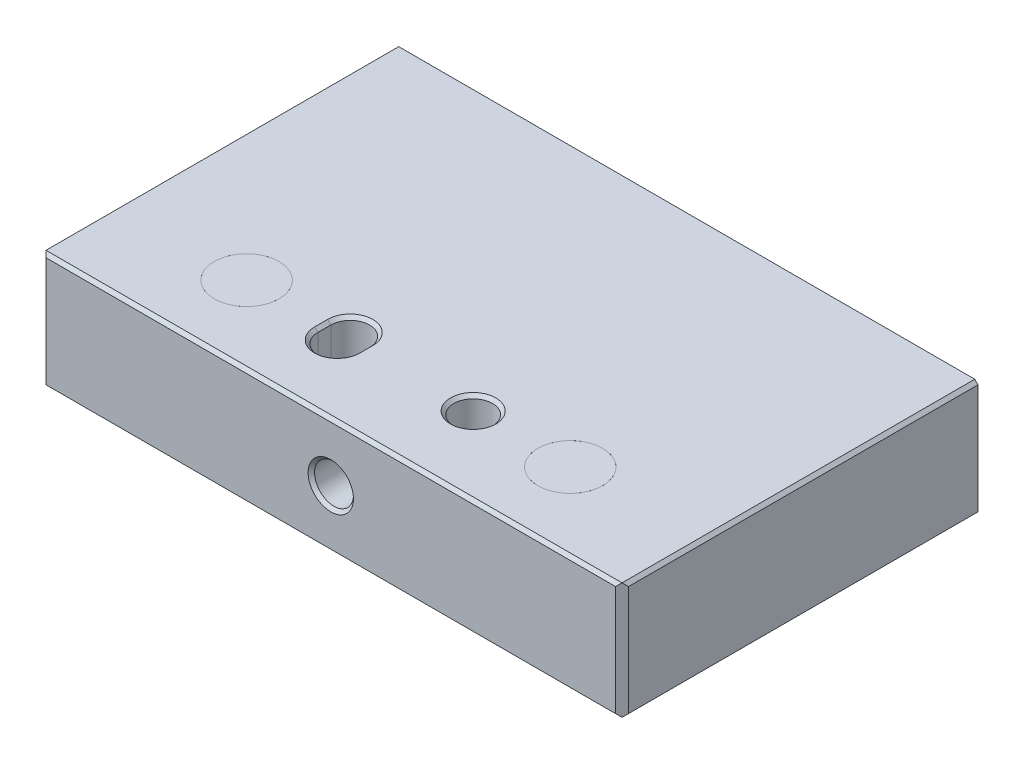
ISO-10303-21;
HEADER;
FILE_DESCRIPTION(('STEP AP214'),'2;1');
FILE_NAME('part.step','',(''),(''),'','','');
FILE_SCHEMA(('AUTOMOTIVE_DESIGN { 1 0 10303 214 1 1 1 1 }'));
ENDSEC;
DATA;
#1=APPLICATION_CONTEXT('core data for automotive mechanical design processes');
#2=APPLICATION_PROTOCOL_DEFINITION('international standard','automotive_design',2000,#1);
#3=PRODUCT_CONTEXT('',#1,'mechanical');
#4=PRODUCT('Part','Part','',(#3));
#5=PRODUCT_RELATED_PRODUCT_CATEGORY('part','',(#4));
#6=PRODUCT_DEFINITION_FORMATION('','',#4);
#7=PRODUCT_DEFINITION_CONTEXT('part definition',#1,'design');
#8=PRODUCT_DEFINITION('design','',#6,#7);
#9=PRODUCT_DEFINITION_SHAPE('','',#8);
#10=(LENGTH_UNIT() NAMED_UNIT(*) SI_UNIT(.MILLI.,.METRE.));
#11=(NAMED_UNIT(*) PLANE_ANGLE_UNIT() SI_UNIT($,.RADIAN.));
#12=(NAMED_UNIT(*) SI_UNIT($,.STERADIAN.) SOLID_ANGLE_UNIT());
#13=UNCERTAINTY_MEASURE_WITH_UNIT(LENGTH_MEASURE(1.E-05),#10,'distance_accuracy_value','');
#14=(GEOMETRIC_REPRESENTATION_CONTEXT(3) GLOBAL_UNCERTAINTY_ASSIGNED_CONTEXT((#13)) GLOBAL_UNIT_ASSIGNED_CONTEXT((#10,
#11,#12)) REPRESENTATION_CONTEXT('',''));
#15=CARTESIAN_POINT('',(0.,0.,0.));
#16=DIRECTION('',(0.,0.,1.));
#17=DIRECTION('',(1.,0.,0.));
#18=AXIS2_PLACEMENT_3D('',#15,#16,#17);
#19=CARTESIAN_POINT('',(-25.,-9.,-12.));
#20=DIRECTION('',(0.,-1.,0.));
#21=DIRECTION('',(0.,0.,-1.));
#22=AXIS2_PLACEMENT_3D('',#19,#20,#21);
#23=CYLINDRICAL_SURFACE('',#22,5.);
#24=CARTESIAN_POINT('',(-25.,9.,-12.));
#25=DIRECTION('',(0.,-1.,0.));
#26=DIRECTION('',(0.,0.,-1.));
#27=AXIS2_PLACEMENT_3D('',#24,#25,#26);
#28=CIRCLE('',#27,5.);
#29=CARTESIAN_POINT('',(-25.,9.,-17.));
#30=VERTEX_POINT('',#29);
#31=EDGE_CURVE('P0_E17',#30,#30,#28,.T.);
#32=ORIENTED_EDGE('',*,*,#31,.T.);
#33=EDGE_LOOP('',(#32));
#34=FACE_BOUND('',#33,.T.);
#35=CARTESIAN_POINT('',(-25.,-9.,-12.));
#36=DIRECTION('',(0.,-1.,0.));
#37=DIRECTION('',(0.,0.,-1.));
#38=AXIS2_PLACEMENT_3D('',#35,#36,#37);
#39=CIRCLE('',#38,5.);
#40=CARTESIAN_POINT('',(-25.,-9.,-17.));
#41=VERTEX_POINT('',#40);
#42=EDGE_CURVE('P0_E10',#41,#41,#39,.F.);
#43=ORIENTED_EDGE('',*,*,#42,.T.);
#44=EDGE_LOOP('',(#43));
#45=FACE_BOUND('',#44,.T.);
#46=ADVANCED_FACE('P0_F14',(#34,#45),#23,.T.);
#47=CARTESIAN_POINT('',(-25.,9.,-12.));
#48=DIRECTION('',(0.,-1.,0.));
#49=DIRECTION('',(0.,0.,-1.));
#50=AXIS2_PLACEMENT_3D('',#47,#48,#49);
#51=PLANE('',#50);
#52=ORIENTED_EDGE('',*,*,#31,.F.);
#53=EDGE_LOOP('',(#52));
#54=FACE_BOUND('',#53,.T.);
#55=ADVANCED_FACE('P0_F15',(#54),#51,.F.);
#56=OPEN_SHELL('',(#46,#55));
#57=SHELL_BASED_SURFACE_MODEL('P0_B1',(#56));
#58=CARTESIAN_POINT('',(25.,-9.,-12.));
#59=DIRECTION('',(0.,-1.,0.));
#60=DIRECTION('',(0.,0.,-1.));
#61=AXIS2_PLACEMENT_3D('',#58,#59,#60);
#62=CYLINDRICAL_SURFACE('',#61,5.);
#63=CARTESIAN_POINT('',(25.,9.,-12.));
#64=DIRECTION('',(0.,-1.,0.));
#65=DIRECTION('',(0.,0.,-1.));
#66=AXIS2_PLACEMENT_3D('',#63,#64,#65);
#67=CIRCLE('',#66,5.);
#68=CARTESIAN_POINT('',(25.,9.,-17.));
#69=VERTEX_POINT('',#68);
#70=EDGE_CURVE('P1_E16',#69,#69,#67,.T.);
#71=ORIENTED_EDGE('',*,*,#70,.T.);
#72=EDGE_LOOP('',(#71));
#73=FACE_BOUND('',#72,.T.);
#74=CARTESIAN_POINT('',(25.,-9.,-12.));
#75=DIRECTION('',(0.,-1.,0.));
#76=DIRECTION('',(0.,0.,-1.));
#77=AXIS2_PLACEMENT_3D('',#74,#75,#76);
#78=CIRCLE('',#77,5.);
#79=CARTESIAN_POINT('',(25.,-9.,-17.));
#80=VERTEX_POINT('',#79);
#81=EDGE_CURVE('P1_E9',#80,#80,#78,.F.);
#82=ORIENTED_EDGE('',*,*,#81,.T.);
#83=EDGE_LOOP('',(#82));
#84=FACE_BOUND('',#83,.T.);
#85=ADVANCED_FACE('P1_F13',(#73,#84),#62,.T.);
#86=CARTESIAN_POINT('',(25.,9.,-12.));
#87=DIRECTION('',(0.,-1.,0.));
#88=DIRECTION('',(0.,0.,-1.));
#89=AXIS2_PLACEMENT_3D('',#86,#87,#88);
#90=PLANE('',#89);
#91=ORIENTED_EDGE('',*,*,#70,.F.);
#92=EDGE_LOOP('',(#91));
#93=FACE_BOUND('',#92,.T.);
#94=ADVANCED_FACE('P1_F14',(#93),#90,.F.);
#95=OPEN_SHELL('',(#85,#94));
#96=SHELL_BASED_SURFACE_MODEL('P1_B1',(#95));
#97=CARTESIAN_POINT('',(44.5,-9.,0.));
#98=DIRECTION('',(0.707106781186548,-0.707106781186548,0.));
#99=DIRECTION('',(0.707106781186548,0.707106781186548,0.));
#100=AXIS2_PLACEMENT_3D('',#97,#98,#99);
#101=PLANE('',#100);
#102=DIRECTION('',(0.,0.,-1.));
#103=VECTOR('',#102,1.);
#104=CARTESIAN_POINT('',(45.,-8.5,0.));
#105=LINE('',#104,#103);
#106=CARTESIAN_POINT('',(45.,-8.5,-1.));
#107=VERTEX_POINT('',#106);
#108=CARTESIAN_POINT('',(45.,-8.5,-55.));
#109=VERTEX_POINT('',#108);
#110=EDGE_CURVE('P2_E246',#107,#109,#105,.T.);
#111=ORIENTED_EDGE('',*,*,#110,.F.);
#112=DIRECTION('',(-0.577350269189666,-0.577350269189626,0.577350269189585));
#113=VECTOR('',#112,1.);
#114=CARTESIAN_POINT('',(45.,-8.5,-1.));
#115=LINE('',#114,#113);
#116=CARTESIAN_POINT('',(44.5,-9.,-0.500000000000018));
#117=VERTEX_POINT('',#116);
#118=EDGE_CURVE('P2_E166',#107,#117,#115,.T.);
#119=ORIENTED_EDGE('',*,*,#118,.T.);
#120=DIRECTION('',(0.,0.,-1.));
#121=VECTOR('',#120,1.);
#122=CARTESIAN_POINT('',(44.5,-9.,0.));
#123=LINE('',#122,#121);
#124=CARTESIAN_POINT('',(44.5,-9.,-55.));
#125=VERTEX_POINT('',#124);
#126=EDGE_CURVE('P2_E110',#125,#117,#123,.F.);
#127=ORIENTED_EDGE('',*,*,#126,.F.);
#128=DIRECTION('',(0.707106781186548,0.707106781186548,0.));
#129=VECTOR('',#128,1.);
#130=CARTESIAN_POINT('',(44.5,-9.,-55.));
#131=LINE('',#130,#129);
#132=EDGE_CURVE('P2_E190',#125,#109,#131,.T.);
#133=ORIENTED_EDGE('',*,*,#132,.T.);
#134=EDGE_LOOP('',(#111,#119,#127,#133));
#135=FACE_BOUND('',#134,.T.);
#136=ADVANCED_FACE('P2_F16',(#135),#101,.T.);
#137=CARTESIAN_POINT('',(0.,0.,2.75));
#138=DIRECTION('',(0.,0.,-1.));
#139=DIRECTION('',(-1.,0.,0.));
#140=AXIS2_PLACEMENT_3D('',#137,#138,#139);
#141=CYLINDRICAL_SURFACE('',#140,3.);
#142=CARTESIAN_POINT('',(0.,0.,-54.5000000000186));
#143=DIRECTION('',(0.,0.,-1.));
#144=DIRECTION('',(1.,0.,0.));
#145=AXIS2_PLACEMENT_3D('',#142,#143,#144);
#146=CIRCLE('',#145,2.99999999992906);
#147=CARTESIAN_POINT('',(2.99999999992906,0.,-54.5000000000186));
#148=VERTEX_POINT('',#147);
#149=EDGE_CURVE('P2_E191',#148,#148,#146,.T.);
#150=ORIENTED_EDGE('',*,*,#149,.T.);
#151=EDGE_LOOP('',(#150));
#152=FACE_BOUND('',#151,.T.);
#153=CARTESIAN_POINT('',(0.,0.,-0.499999999988177));
#154=DIRECTION('',(0.,0.,1.));
#155=DIRECTION('',(-1.,0.,0.));
#156=AXIS2_PLACEMENT_3D('',#153,#154,#155);
#157=CIRCLE('',#156,2.9999999999859);
#158=CARTESIAN_POINT('',(-2.9999999999859,0.,-0.499999999988177));
#159=VERTEX_POINT('',#158);
#160=EDGE_CURVE('P2_E79',#159,#159,#157,.T.);
#161=ORIENTED_EDGE('',*,*,#160,.T.);
#162=EDGE_LOOP('',(#161));
#163=FACE_BOUND('',#162,.T.);
#164=ADVANCED_FACE('P2_F781',(#152,#163),#141,.F.);
#165=CARTESIAN_POINT('',(-45.,-8.5,0.));
#166=DIRECTION('',(-0.707106781186548,-0.707106781186548,0.));
#167=DIRECTION('',(0.707106781186548,-0.707106781186548,0.));
#168=AXIS2_PLACEMENT_3D('',#165,#166,#167);
#169=PLANE('',#168);
#170=DIRECTION('',(0.,0.,-1.));
#171=VECTOR('',#170,1.);
#172=CARTESIAN_POINT('',(-44.5,-9.,0.));
#173=LINE('',#172,#171);
#174=CARTESIAN_POINT('',(-44.5,-9.,-0.499999999999982));
#175=VERTEX_POINT('',#174);
#176=CARTESIAN_POINT('',(-44.5,-9.,-55.));
#177=VERTEX_POINT('',#176);
#178=EDGE_CURVE('P2_E116',#175,#177,#173,.T.);
#179=ORIENTED_EDGE('',*,*,#178,.F.);
#180=DIRECTION('',(-0.577350269189666,0.577350269189626,-0.577350269189585));
#181=VECTOR('',#180,1.);
#182=CARTESIAN_POINT('',(-44.5,-9.,-0.499999999999965));
#183=LINE('',#182,#181);
#184=CARTESIAN_POINT('',(-45.,-8.5,-0.999999999999983));
#185=VERTEX_POINT('',#184);
#186=EDGE_CURVE('P2_E184',#175,#185,#183,.T.);
#187=ORIENTED_EDGE('',*,*,#186,.T.);
#188=DIRECTION('',(0.,0.,1.));
#189=VECTOR('',#188,1.);
#190=CARTESIAN_POINT('',(-45.,-8.5,0.));
#191=LINE('',#190,#189);
#192=CARTESIAN_POINT('',(-45.,-8.5,-55.));
#193=VERTEX_POINT('',#192);
#194=EDGE_CURVE('P2_E194',#193,#185,#191,.T.);
#195=ORIENTED_EDGE('',*,*,#194,.F.);
#196=DIRECTION('',(0.707106781186548,-0.707106781186548,0.));
#197=VECTOR('',#196,1.);
#198=CARTESIAN_POINT('',(-45.,-8.5,-55.));
#199=LINE('',#198,#197);
#200=EDGE_CURVE('P2_E187',#193,#177,#199,.T.);
#201=ORIENTED_EDGE('',*,*,#200,.T.);
#202=EDGE_LOOP('',(#179,#187,#195,#201));
#203=FACE_BOUND('',#202,.T.);
#204=ADVANCED_FACE('P2_F438',(#203),#169,.T.);
#205=CARTESIAN_POINT('',(-44.,-9.,0.));
#206=DIRECTION('',(0.707106781186498,0.,-0.707106781186598));
#207=DIRECTION('',(-0.707106781186598,0.,-0.707106781186498));
#208=AXIS2_PLACEMENT_3D('',#205,#206,#207);
#209=PLANE('',#208);
#210=DIRECTION('',(0.577350269189666,-0.577350269189626,0.577350269189585));
#211=VECTOR('',#210,1.);
#212=CARTESIAN_POINT('',(-44.5,9.,-0.499999999999965));
#213=LINE('',#212,#211);
#214=CARTESIAN_POINT('',(-44.5,9.,-0.499999999999982));
#215=VERTEX_POINT('',#214);
#216=CARTESIAN_POINT('',(-44.,8.5,0.));
#217=VERTEX_POINT('',#216);
#218=EDGE_CURVE('P2_E178',#215,#217,#213,.T.);
#219=ORIENTED_EDGE('',*,*,#218,.F.);
#220=DIRECTION('',(0.577350269189666,0.577350269189626,0.577350269189585));
#221=VECTOR('',#220,1.);
#222=CARTESIAN_POINT('',(-45.0000000000001,8.5,-0.99999999999993));
#223=LINE('',#222,#221);
#224=CARTESIAN_POINT('',(-45.,8.5,-0.999999999999964));
#225=VERTEX_POINT('',#224);
#226=EDGE_CURVE('P2_E181',#225,#215,#223,.T.);
#227=ORIENTED_EDGE('',*,*,#226,.F.);
#228=DIRECTION('',(0.,1.,0.));
#229=VECTOR('',#228,1.);
#230=CARTESIAN_POINT('',(-45.,8.5,-1.));
#231=LINE('',#230,#229);
#232=EDGE_CURVE('P2_E239',#185,#225,#231,.T.);
#233=ORIENTED_EDGE('',*,*,#232,.F.);
#234=ORIENTED_EDGE('',*,*,#186,.F.);
#235=DIRECTION('',(0.577350269189626,0.577350269189626,0.577350269189626));
#236=VECTOR('',#235,1.);
#237=CARTESIAN_POINT('',(-44.5,-9.,-0.5));
#238=LINE('',#237,#236);
#239=CARTESIAN_POINT('',(-44.,-8.5,0.));
#240=VERTEX_POINT('',#239);
#241=EDGE_CURVE('P2_E175',#175,#240,#238,.T.);
#242=ORIENTED_EDGE('',*,*,#241,.T.);
#243=DIRECTION('',(0.,1.,0.));
#244=VECTOR('',#243,1.);
#245=CARTESIAN_POINT('',(-44.,0.,0.));
#246=LINE('',#245,#244);
#247=EDGE_CURVE('P2_E231',#217,#240,#246,.F.);
#248=ORIENTED_EDGE('',*,*,#247,.F.);
#249=EDGE_LOOP('',(#219,#227,#233,#234,#242,#248));
#250=FACE_BOUND('',#249,.T.);
#251=ADVANCED_FACE('P2_F456',(#250),#209,.F.);
#252=CARTESIAN_POINT('',(-45.,-9.,-0.5));
#253=DIRECTION('',(0.,0.707106781186548,-0.707106781186548));
#254=DIRECTION('',(0.,0.707106781186548,0.707106781186548));
#255=AXIS2_PLACEMENT_3D('',#252,#253,#254);
#256=PLANE('',#255);
#257=ORIENTED_EDGE('',*,*,#241,.F.);
#258=DIRECTION('',(1.,0.,0.));
#259=VECTOR('',#258,1.);
#260=CARTESIAN_POINT('',(-44.5,-9.,-0.5));
#261=LINE('',#260,#259);
#262=EDGE_CURVE('P2_E106',#117,#175,#261,.F.);
#263=ORIENTED_EDGE('',*,*,#262,.F.);
#264=DIRECTION('',(-0.577350269189666,0.577350269189626,0.577350269189585));
#265=VECTOR('',#264,1.);
#266=CARTESIAN_POINT('',(44.5,-9.,-0.500000000000035));
#267=LINE('',#266,#265);
#268=CARTESIAN_POINT('',(44.,-8.5,0.));
#269=VERTEX_POINT('',#268);
#270=EDGE_CURVE('P2_E163',#117,#269,#267,.T.);
#271=ORIENTED_EDGE('',*,*,#270,.T.);
#272=DIRECTION('',(1.,0.,0.));
#273=VECTOR('',#272,1.);
#274=CARTESIAN_POINT('',(0.,-8.5,0.));
#275=LINE('',#274,#273);
#276=EDGE_CURVE('P2_E223',#240,#269,#275,.T.);
#277=ORIENTED_EDGE('',*,*,#276,.F.);
#278=EDGE_LOOP('',(#257,#263,#271,#277));
#279=FACE_BOUND('',#278,.T.);
#280=ADVANCED_FACE('P2_F448',(#279),#256,.F.);
#281=CARTESIAN_POINT('',(45.,-9.,-1.));
#282=DIRECTION('',(-0.707106781186498,0.,-0.707106781186598));
#283=DIRECTION('',(-0.707106781186598,0.,0.707106781186498));
#284=AXIS2_PLACEMENT_3D('',#281,#282,#283);
#285=PLANE('',#284);
#286=ORIENTED_EDGE('',*,*,#270,.F.);
#287=ORIENTED_EDGE('',*,*,#118,.F.);
#288=DIRECTION('',(0.,1.,0.));
#289=VECTOR('',#288,1.);
#290=CARTESIAN_POINT('',(45.,-8.5,-1.));
#291=LINE('',#290,#289);
#292=CARTESIAN_POINT('',(45.,8.5,-1.));
#293=VERTEX_POINT('',#292);
#294=EDGE_CURVE('P2_E195',#293,#107,#291,.F.);
#295=ORIENTED_EDGE('',*,*,#294,.F.);
#296=DIRECTION('',(0.577350269189666,-0.577350269189626,-0.577350269189585));
#297=VECTOR('',#296,1.);
#298=CARTESIAN_POINT('',(44.5,9.,-0.500000000000035));
#299=LINE('',#298,#297);
#300=CARTESIAN_POINT('',(44.5,9.,-0.500000000000019));
#301=VERTEX_POINT('',#300);
#302=EDGE_CURVE('P2_E169',#301,#293,#299,.T.);
#303=ORIENTED_EDGE('',*,*,#302,.F.);
#304=DIRECTION('',(0.577350269189666,0.577350269189626,-0.577350269189585));
#305=VECTOR('',#304,1.);
#306=CARTESIAN_POINT('',(43.9999999999999,8.5,0.));
#307=LINE('',#306,#305);
#308=CARTESIAN_POINT('',(44.,8.5,0.));
#309=VERTEX_POINT('',#308);
#310=EDGE_CURVE('P2_E172',#309,#301,#307,.T.);
#311=ORIENTED_EDGE('',*,*,#310,.F.);
#312=DIRECTION('',(0.,1.,0.));
#313=VECTOR('',#312,1.);
#314=CARTESIAN_POINT('',(44.,0.,0.));
#315=LINE('',#314,#313);
#316=EDGE_CURVE('P2_E219',#269,#309,#315,.T.);
#317=ORIENTED_EDGE('',*,*,#316,.F.);
#318=EDGE_LOOP('',(#286,#287,#295,#303,#311,#317));
#319=FACE_BOUND('',#318,.T.);
#320=ADVANCED_FACE('P2_F451',(#319),#285,.F.);
#321=CARTESIAN_POINT('',(0.,0.,-5.6843418860808E-11));
#322=DIRECTION('',(0.,0.,1.));
#323=DIRECTION('',(1.,0.,0.));
#324=AXIS2_PLACEMENT_3D('',#321,#322,#323);
#325=CONICAL_SURFACE('',#324,3.49999999991724,0.785398163397448);
#326=ORIENTED_EDGE('',*,*,#160,.F.);
#327=EDGE_LOOP('',(#326));
#328=FACE_BOUND('',#327,.T.);
#329=CARTESIAN_POINT('',(0.,0.,0.));
#330=DIRECTION('',(0.,0.,1.));
#331=DIRECTION('',(1.,0.,0.));
#332=AXIS2_PLACEMENT_3D('',#329,#330,#331);
#333=CIRCLE('',#332,3.49999999997408);
#334=CARTESIAN_POINT('',(3.49999999997408,0.,0.));
#335=VERTEX_POINT('',#334);
#336=EDGE_CURVE('P2_E162',#335,#335,#333,.F.);
#337=ORIENTED_EDGE('',*,*,#336,.F.);
#338=EDGE_LOOP('',(#337));
#339=FACE_BOUND('',#338,.T.);
#340=ADVANCED_FACE('P2_F743',(#328,#339),#325,.F.);
#341=CARTESIAN_POINT('',(-25.,-9.00000000001455,-12.));
#342=DIRECTION('',(0.,-1.,0.));
#343=DIRECTION('',(0.,0.,-1.));
#344=AXIS2_PLACEMENT_3D('',#341,#342,#343);
#345=CONICAL_SURFACE('',#344,5.00000000002956,0.785398163432451);
#346=CARTESIAN_POINT('',(-25.,-8.188,-12.));
#347=DIRECTION('',(0.,-1.,0.));
#348=DIRECTION('',(0.,0.,-1.));
#349=AXIS2_PLACEMENT_3D('',#346,#347,#348);
#350=CIRCLE('',#349,4.188);
#351=CARTESIAN_POINT('',(-25.,-8.188,-16.188));
#352=VERTEX_POINT('',#351);
#353=EDGE_CURVE('P2_E159',#352,#352,#350,.F.);
#354=ORIENTED_EDGE('',*,*,#353,.T.);
#355=EDGE_LOOP('',(#354));
#356=FACE_BOUND('',#355,.T.);
#357=CARTESIAN_POINT('',(-25.,-8.99999999998045,-12.));
#358=DIRECTION('',(0.,-1.,0.));
#359=DIRECTION('',(0.,0.,-1.));
#360=AXIS2_PLACEMENT_3D('',#357,#358,#359);
#361=CIRCLE('',#360,4.99999999999545);
#362=CARTESIAN_POINT('',(-25.,-8.99999999998045,-16.9999999999955));
#363=VERTEX_POINT('',#362);
#364=EDGE_CURVE('P2_E19',#363,#363,#361,.F.);
#365=ORIENTED_EDGE('',*,*,#364,.F.);
#366=EDGE_LOOP('',(#365));
#367=FACE_BOUND('',#366,.T.);
#368=ADVANCED_FACE('P2_F734',(#356,#367),#345,.F.);
#369=CARTESIAN_POINT('',(25.,-9.00000000001455,-12.));
#370=DIRECTION('',(0.,-1.,0.));
#371=DIRECTION('',(0.,0.,-1.));
#372=AXIS2_PLACEMENT_3D('',#369,#370,#371);
#373=CONICAL_SURFACE('',#372,5.00000000001819,0.785398163397448);
#374=CARTESIAN_POINT('',(25.,-8.188,-12.));
#375=DIRECTION('',(0.,-1.,0.));
#376=DIRECTION('',(0.,0.,-1.));
#377=AXIS2_PLACEMENT_3D('',#374,#375,#376);
#378=CIRCLE('',#377,4.188);
#379=CARTESIAN_POINT('',(25.,-8.188,-16.188));
#380=VERTEX_POINT('',#379);
#381=EDGE_CURVE('P2_E156',#380,#380,#378,.F.);
#382=ORIENTED_EDGE('',*,*,#381,.T.);
#383=EDGE_LOOP('',(#382));
#384=FACE_BOUND('',#383,.T.);
#385=CARTESIAN_POINT('',(25.,-9.00000000001455,-12.));
#386=DIRECTION('',(0.,-1.,0.));
#387=DIRECTION('',(0.,0.,-1.));
#388=AXIS2_PLACEMENT_3D('',#385,#386,#387);
#389=CIRCLE('',#388,5.00000000001819);
#390=CARTESIAN_POINT('',(25.,-9.00000000001455,-17.0000000000182));
#391=VERTEX_POINT('',#390);
#392=EDGE_CURVE('P2_E101',#391,#391,#389,.F.);
#393=ORIENTED_EDGE('',*,*,#392,.F.);
#394=EDGE_LOOP('',(#393));
#395=FACE_BOUND('',#394,.T.);
#396=ADVANCED_FACE('P2_F725',(#384,#395),#373,.F.);
#397=CARTESIAN_POINT('',(10.,-8.99999999995771,-12.));
#398=DIRECTION('',(0.,-1.,0.));
#399=DIRECTION('',(0.,0.,-1.));
#400=AXIS2_PLACEMENT_3D('',#397,#398,#399);
#401=CONICAL_SURFACE('',#400,3.49999999992633,0.785398163454292);
#402=CARTESIAN_POINT('',(10.,-8.5,-12.));
#403=DIRECTION('',(0.,-1.,0.));
#404=DIRECTION('',(0.,0.,-1.));
#405=AXIS2_PLACEMENT_3D('',#402,#403,#404);
#406=CIRCLE('',#405,3.);
#407=CARTESIAN_POINT('',(10.,-8.5,-15.));
#408=VERTEX_POINT('',#407);
#409=EDGE_CURVE('P2_E123',#408,#408,#406,.F.);
#410=ORIENTED_EDGE('',*,*,#409,.T.);
#411=EDGE_LOOP('',(#410));
#412=FACE_BOUND('',#411,.T.);
#413=CARTESIAN_POINT('',(10.,-9.00000000000546,-12.));
#414=DIRECTION('',(0.,-1.,0.));
#415=DIRECTION('',(0.,0.,-1.));
#416=AXIS2_PLACEMENT_3D('',#413,#414,#415);
#417=CIRCLE('',#416,3.49999999997408);
#418=CARTESIAN_POINT('',(10.,-9.00000000000546,-15.4999999999741));
#419=VERTEX_POINT('',#418);
#420=EDGE_CURVE('P2_E95',#419,#419,#417,.F.);
#421=ORIENTED_EDGE('',*,*,#420,.F.);
#422=EDGE_LOOP('',(#421));
#423=FACE_BOUND('',#422,.T.);
#424=ADVANCED_FACE('P2_F717',(#412,#423),#401,.F.);
#425=CARTESIAN_POINT('',(-13.,-8.5,-13.));
#426=DIRECTION('',(-0.707106781186548,0.707106781186548,0.));
#427=DIRECTION('',(-0.707106781186548,-0.707106781186548,0.));
#428=AXIS2_PLACEMENT_3D('',#425,#426,#427);
#429=PLANE('',#428);
#430=DIRECTION('',(0.707106781186443,0.707106781186652,0.));
#431=VECTOR('',#430,1.);
#432=CARTESIAN_POINT('',(-499000.,-498995.500000148,-13.));
#433=LINE('',#432,#431);
#434=CARTESIAN_POINT('',(-13.5000000000209,-9.00000000005355,-13.));
#435=VERTEX_POINT('',#434);
#436=CARTESIAN_POINT('',(-12.9999999999942,-8.49999999999238,-13.));
#437=VERTEX_POINT('',#436);
#438=EDGE_CURVE('P2_E67',#435,#437,#433,.T.);
#439=ORIENTED_EDGE('',*,*,#438,.T.);
#440=DIRECTION('',(0.,0.,1.));
#441=VECTOR('',#440,1.);
#442=CARTESIAN_POINT('',(-13.,-8.5,-13.));
#443=LINE('',#442,#441);
#444=CARTESIAN_POINT('',(-12.9999999999942,-8.49999999999238,-11.));
#445=VERTEX_POINT('',#444);
#446=EDGE_CURVE('P2_E120',#437,#445,#443,.T.);
#447=ORIENTED_EDGE('',*,*,#446,.T.);
#448=DIRECTION('',(0.707106781186443,0.707106781186652,0.));
#449=VECTOR('',#448,1.);
#450=CARTESIAN_POINT('',(-499000.,-498995.500000148,-11.));
#451=LINE('',#450,#449);
#452=CARTESIAN_POINT('',(-13.5000000000209,-9.00000000005355,-11.));
#453=VERTEX_POINT('',#452);
#454=EDGE_CURVE('P2_E85',#445,#453,#451,.F.);
#455=ORIENTED_EDGE('',*,*,#454,.T.);
#456=DIRECTION('',(0.,0.,-1.));
#457=VECTOR('',#456,1.);
#458=CARTESIAN_POINT('',(-13.5,-9.,0.));
#459=LINE('',#458,#457);
#460=EDGE_CURVE('P2_E82',#435,#453,#459,.F.);
#461=ORIENTED_EDGE('',*,*,#460,.F.);
#462=EDGE_LOOP('',(#439,#447,#455,#461));
#463=FACE_BOUND('',#462,.T.);
#464=ADVANCED_FACE('P2_F83',(#463),#429,.F.);
#465=CARTESIAN_POINT('',(-10.,-9.00000000001455,-13.));
#466=DIRECTION('',(0.,-1.,0.));
#467=DIRECTION('',(0.,0.,-1.));
#468=AXIS2_PLACEMENT_3D('',#465,#466,#467);
#469=CONICAL_SURFACE('',#468,3.49999999996498,0.785398163397448);
#470=CARTESIAN_POINT('',(-10.,-8.5,-13.));
#471=DIRECTION('',(0.,-1.,0.));
#472=DIRECTION('',(0.,0.,-1.));
#473=AXIS2_PLACEMENT_3D('',#470,#471,#472);
#474=CIRCLE('',#473,3.);
#475=CARTESIAN_POINT('',(-7.,-8.5,-13.));
#476=VERTEX_POINT('',#475);
#477=EDGE_CURVE('P2_E74',#476,#437,#474,.F.);
#478=ORIENTED_EDGE('',*,*,#477,.T.);
#479=ORIENTED_EDGE('',*,*,#438,.F.);
#480=CARTESIAN_POINT('',(-10.,-9.0000000000714,-13.));
#481=DIRECTION('',(0.,-1.,0.));
#482=DIRECTION('',(0.,0.,-1.));
#483=AXIS2_PLACEMENT_3D('',#480,#481,#482);
#484=CIRCLE('',#483,3.50000000002183);
#485=CARTESIAN_POINT('',(-6.4999999999643,-9.0000000000357,-13.));
#486=VERTEX_POINT('',#485);
#487=EDGE_CURVE('P2_E71',#486,#435,#484,.F.);
#488=ORIENTED_EDGE('',*,*,#487,.F.);
#489=DIRECTION('',(-0.707106781186548,0.707106781186548,0.));
#490=VECTOR('',#489,1.);
#491=CARTESIAN_POINT('',(-6.5,-9.,-13.));
#492=LINE('',#491,#490);
#493=EDGE_CURVE('P2_E61',#486,#476,#492,.T.);
#494=ORIENTED_EDGE('',*,*,#493,.T.);
#495=EDGE_LOOP('',(#478,#479,#488,#494));
#496=FACE_BOUND('',#495,.T.);
#497=ADVANCED_FACE('P2_F69',(#496),#469,.F.);
#498=CARTESIAN_POINT('',(-6.5,-9.,-13.));
#499=DIRECTION('',(0.707106781186548,0.707106781186548,0.));
#500=DIRECTION('',(-0.707106781186548,0.707106781186548,0.));
#501=AXIS2_PLACEMENT_3D('',#498,#499,#500);
#502=PLANE('',#501);
#503=ORIENTED_EDGE('',*,*,#493,.F.);
#504=DIRECTION('',(0.,0.,-1.));
#505=VECTOR('',#504,1.);
#506=CARTESIAN_POINT('',(-6.5,-9.,0.));
#507=LINE('',#506,#505);
#508=CARTESIAN_POINT('',(-6.50000000001717,-9.00000000001091,-11.));
#509=VERTEX_POINT('',#508);
#510=EDGE_CURVE('P2_E93',#509,#486,#507,.T.);
#511=ORIENTED_EDGE('',*,*,#510,.F.);
#512=DIRECTION('',(-0.707106781186443,0.707106781186652,0.));
#513=VECTOR('',#512,1.);
#514=CARTESIAN_POINT('',(498980.,-498995.500000148,-11.0000000000611));
#515=LINE('',#514,#513);
#516=CARTESIAN_POINT('',(-7.00000000000125,-8.49999999999238,-11.));
#517=VERTEX_POINT('',#516);
#518=EDGE_CURVE('P2_E127',#509,#517,#515,.T.);
#519=ORIENTED_EDGE('',*,*,#518,.T.);
#520=DIRECTION('',(0.,0.,-1.));
#521=VECTOR('',#520,1.);
#522=CARTESIAN_POINT('',(-7.,-8.5,-13.));
#523=LINE('',#522,#521);
#524=EDGE_CURVE('P2_E137',#517,#476,#523,.T.);
#525=ORIENTED_EDGE('',*,*,#524,.T.);
#526=EDGE_LOOP('',(#503,#511,#519,#525));
#527=FACE_BOUND('',#526,.T.);
#528=ADVANCED_FACE('P2_F261',(#527),#502,.F.);
#529=CARTESIAN_POINT('',(-10.,-9.00000000001455,-11.));
#530=DIRECTION('',(0.,-1.,0.));
#531=DIRECTION('',(0.,0.,-1.));
#532=AXIS2_PLACEMENT_3D('',#529,#530,#531);
#533=CONICAL_SURFACE('',#532,3.49999999996498,0.785398163397448);
#534=CARTESIAN_POINT('',(-10.,-8.5,-11.));
#535=DIRECTION('',(0.,-1.,0.));
#536=DIRECTION('',(0.,0.,-1.));
#537=AXIS2_PLACEMENT_3D('',#534,#535,#536);
#538=CIRCLE('',#537,3.);
#539=EDGE_CURVE('P2_E130',#445,#517,#538,.F.);
#540=ORIENTED_EDGE('',*,*,#539,.T.);
#541=ORIENTED_EDGE('',*,*,#518,.F.);
#542=CARTESIAN_POINT('',(-10.,-9.0000000000714,-11.));
#543=DIRECTION('',(0.,-1.,0.));
#544=DIRECTION('',(0.,0.,-1.));
#545=AXIS2_PLACEMENT_3D('',#542,#543,#544);
#546=CIRCLE('',#545,3.50000000002183);
#547=EDGE_CURVE('P2_E89',#453,#509,#546,.F.);
#548=ORIENTED_EDGE('',*,*,#547,.F.);
#549=ORIENTED_EDGE('',*,*,#454,.F.);
#550=EDGE_LOOP('',(#540,#541,#548,#549));
#551=FACE_BOUND('',#550,.T.);
#552=ADVANCED_FACE('P2_F255',(#551),#533,.F.);
#553=CARTESIAN_POINT('',(-44.5,-9.,0.));
#554=DIRECTION('',(0.,-1.,0.));
#555=DIRECTION('',(0.,0.,-1.));
#556=AXIS2_PLACEMENT_3D('',#553,#554,#555);
#557=PLANE('',#556);
#558=ORIENTED_EDGE('',*,*,#460,.T.);
#559=ORIENTED_EDGE('',*,*,#547,.T.);
#560=ORIENTED_EDGE('',*,*,#510,.T.);
#561=ORIENTED_EDGE('',*,*,#487,.T.);
#562=EDGE_LOOP('',(#558,#559,#560,#561));
#563=FACE_BOUND('',#562,.T.);
#564=ORIENTED_EDGE('',*,*,#420,.T.);
#565=EDGE_LOOP('',(#564));
#566=FACE_BOUND('',#565,.T.);
#567=ORIENTED_EDGE('',*,*,#392,.T.);
#568=EDGE_LOOP('',(#567));
#569=FACE_BOUND('',#568,.T.);
#570=ORIENTED_EDGE('',*,*,#364,.T.);
#571=EDGE_LOOP('',(#570));
#572=FACE_BOUND('',#571,.T.);
#573=ORIENTED_EDGE('',*,*,#126,.T.);
#574=ORIENTED_EDGE('',*,*,#262,.T.);
#575=ORIENTED_EDGE('',*,*,#178,.T.);
#576=DIRECTION('',(1.,0.,0.));
#577=VECTOR('',#576,1.);
#578=CARTESIAN_POINT('',(0.,-9.,-55.));
#579=LINE('',#578,#577);
#580=EDGE_CURVE('P2_E316',#177,#125,#579,.T.);
#581=ORIENTED_EDGE('',*,*,#580,.T.);
#582=EDGE_LOOP('',(#573,#574,#575,#581));
#583=FACE_BOUND('',#582,.T.);
#584=ADVANCED_FACE('P2_F91',(#563,#566,#569,#572,#583),#557,.T.);
#585=CARTESIAN_POINT('',(45.,-8.5,0.));
#586=DIRECTION('',(1.,0.,0.));
#587=DIRECTION('',(0.,0.,-1.));
#588=AXIS2_PLACEMENT_3D('',#585,#586,#587);
#589=PLANE('',#588);
#590=DIRECTION('',(0.,0.,1.));
#591=VECTOR('',#590,1.);
#592=CARTESIAN_POINT('',(45.,8.5,0.));
#593=LINE('',#592,#591);
#594=CARTESIAN_POINT('',(45.,8.5,-55.));
#595=VERTEX_POINT('',#594);
#596=EDGE_CURVE('P2_E133',#293,#595,#593,.F.);
#597=ORIENTED_EDGE('',*,*,#596,.F.);
#598=ORIENTED_EDGE('',*,*,#294,.T.);
#599=ORIENTED_EDGE('',*,*,#110,.T.);
#600=DIRECTION('',(0.,1.,0.));
#601=VECTOR('',#600,1.);
#602=CARTESIAN_POINT('',(45.,0.,-55.));
#603=LINE('',#602,#601);
#604=EDGE_CURVE('P2_E314',#109,#595,#603,.T.);
#605=ORIENTED_EDGE('',*,*,#604,.T.);
#606=EDGE_LOOP('',(#597,#598,#599,#605));
#607=FACE_BOUND('',#606,.T.);
#608=ADVANCED_FACE('P2_F468',(#607),#589,.T.);
#609=CARTESIAN_POINT('',(0.,0.,-55.0000000000068));
#610=DIRECTION('',(0.,0.,-1.));
#611=DIRECTION('',(-1.,0.,0.));
#612=AXIS2_PLACEMENT_3D('',#609,#610,#611);
#613=CONICAL_SURFACE('',#612,3.49999999991724,0.785398163397448);
#614=ORIENTED_EDGE('',*,*,#149,.F.);
#615=EDGE_LOOP('',(#614));
#616=FACE_BOUND('',#615,.T.);
#617=CARTESIAN_POINT('',(0.,0.,-55.0000000000068));
#618=DIRECTION('',(0.,0.,-1.));
#619=DIRECTION('',(-1.,0.,0.));
#620=AXIS2_PLACEMENT_3D('',#617,#618,#619);
#621=CIRCLE('',#620,3.49999999991724);
#622=CARTESIAN_POINT('',(-3.49999999991724,0.,-55.0000000000068));
#623=VERTEX_POINT('',#622);
#624=EDGE_CURVE('P2_E214',#623,#623,#621,.T.);
#625=ORIENTED_EDGE('',*,*,#624,.T.);
#626=EDGE_LOOP('',(#625));
#627=FACE_BOUND('',#626,.T.);
#628=ADVANCED_FACE('P2_F470',(#616,#627),#613,.F.);
#629=CARTESIAN_POINT('',(-45.,8.5,0.));
#630=DIRECTION('',(-1.,0.,0.));
#631=DIRECTION('',(0.,0.,1.));
#632=AXIS2_PLACEMENT_3D('',#629,#630,#631);
#633=PLANE('',#632);
#634=ORIENTED_EDGE('',*,*,#194,.T.);
#635=ORIENTED_EDGE('',*,*,#232,.T.);
#636=DIRECTION('',(0.,0.,1.));
#637=VECTOR('',#636,1.);
#638=CARTESIAN_POINT('',(-45.,8.5,0.));
#639=LINE('',#638,#637);
#640=CARTESIAN_POINT('',(-45.,8.5,-55.));
#641=VERTEX_POINT('',#640);
#642=EDGE_CURVE('P2_E301',#641,#225,#639,.T.);
#643=ORIENTED_EDGE('',*,*,#642,.F.);
#644=DIRECTION('',(0.,1.,0.));
#645=VECTOR('',#644,1.);
#646=CARTESIAN_POINT('',(-45.,0.,-55.));
#647=LINE('',#646,#645);
#648=EDGE_CURVE('P2_E319',#641,#193,#647,.F.);
#649=ORIENTED_EDGE('',*,*,#648,.T.);
#650=EDGE_LOOP('',(#634,#635,#643,#649));
#651=FACE_BOUND('',#650,.T.);
#652=ADVANCED_FACE('P2_F460',(#651),#633,.T.);
#653=CARTESIAN_POINT('',(0.,0.,0.));
#654=DIRECTION('',(0.,0.,1.));
#655=DIRECTION('',(1.,0.,0.));
#656=AXIS2_PLACEMENT_3D('',#653,#654,#655);
#657=PLANE('',#656);
#658=ORIENTED_EDGE('',*,*,#336,.T.);
#659=EDGE_LOOP('',(#658));
#660=FACE_BOUND('',#659,.T.);
#661=ORIENTED_EDGE('',*,*,#276,.T.);
#662=ORIENTED_EDGE('',*,*,#316,.T.);
#663=DIRECTION('',(1.,0.,0.));
#664=VECTOR('',#663,1.);
#665=CARTESIAN_POINT('',(-45.,8.5,0.));
#666=LINE('',#665,#664);
#667=EDGE_CURVE('P2_E298',#309,#217,#666,.F.);
#668=ORIENTED_EDGE('',*,*,#667,.T.);
#669=ORIENTED_EDGE('',*,*,#247,.T.);
#670=EDGE_LOOP('',(#661,#662,#668,#669));
#671=FACE_BOUND('',#670,.T.);
#672=ADVANCED_FACE('P2_F452',(#660,#671),#657,.T.);
#673=CARTESIAN_POINT('',(-25.,9.9,-12.));
#674=DIRECTION('',(0.,-1.,0.));
#675=DIRECTION('',(0.,0.,-1.));
#676=AXIS2_PLACEMENT_3D('',#673,#674,#675);
#677=CYLINDRICAL_SURFACE('',#676,4.188);
#678=CARTESIAN_POINT('',(-25.,8.18800000001829,-12.));
#679=DIRECTION('',(0.,1.,0.));
#680=DIRECTION('',(1.,0.,0.));
#681=AXIS2_PLACEMENT_3D('',#678,#679,#680);
#682=CIRCLE('',#681,4.18800000002193);
#683=CARTESIAN_POINT('',(-20.8119999999781,8.18800000001829,-12.));
#684=VERTEX_POINT('',#683);
#685=EDGE_CURVE('P2_E234',#684,#684,#682,.T.);
#686=ORIENTED_EDGE('',*,*,#685,.T.);
#687=EDGE_LOOP('',(#686));
#688=FACE_BOUND('',#687,.T.);
#689=ORIENTED_EDGE('',*,*,#353,.F.);
#690=EDGE_LOOP('',(#689));
#691=FACE_BOUND('',#690,.T.);
#692=ADVANCED_FACE('P2_F538',(#688,#691),#677,.F.);
#693=CARTESIAN_POINT('',(25.,9.9,-12.));
#694=DIRECTION('',(0.,-1.,0.));
#695=DIRECTION('',(0.,0.,-1.));
#696=AXIS2_PLACEMENT_3D('',#693,#694,#695);
#697=CYLINDRICAL_SURFACE('',#696,4.188);
#698=CARTESIAN_POINT('',(25.,8.18800000001829,-12.));
#699=DIRECTION('',(0.,1.,0.));
#700=DIRECTION('',(1.,0.,0.));
#701=AXIS2_PLACEMENT_3D('',#698,#699,#700);
#702=CIRCLE('',#701,4.18799999997645);
#703=CARTESIAN_POINT('',(29.1879999999765,8.18800000001829,-12.));
#704=VERTEX_POINT('',#703);
#705=EDGE_CURVE('P2_E293',#704,#704,#702,.T.);
#706=ORIENTED_EDGE('',*,*,#705,.T.);
#707=EDGE_LOOP('',(#706));
#708=FACE_BOUND('',#707,.T.);
#709=ORIENTED_EDGE('',*,*,#381,.F.);
#710=EDGE_LOOP('',(#709));
#711=FACE_BOUND('',#710,.T.);
#712=ADVANCED_FACE('P2_F534',(#708,#711),#697,.F.);
#713=CARTESIAN_POINT('',(10.,9.9,-12.));
#714=DIRECTION('',(0.,-1.,0.));
#715=DIRECTION('',(0.,0.,-1.));
#716=AXIS2_PLACEMENT_3D('',#713,#714,#715);
#717=CYLINDRICAL_SURFACE('',#716,3.);
#718=CARTESIAN_POINT('',(10.,8.49999999996953,-12.));
#719=DIRECTION('',(0.,1.,0.));
#720=DIRECTION('',(1.,0.,0.));
#721=AXIS2_PLACEMENT_3D('',#718,#719,#720);
#722=CIRCLE('',#721,2.99999999997681);
#723=CARTESIAN_POINT('',(12.9999999999768,8.49999999996953,-12.));
#724=VERTEX_POINT('',#723);
#725=EDGE_CURVE('P2_E290',#724,#724,#722,.T.);
#726=ORIENTED_EDGE('',*,*,#725,.T.);
#727=EDGE_LOOP('',(#726));
#728=FACE_BOUND('',#727,.T.);
#729=ORIENTED_EDGE('',*,*,#409,.F.);
#730=EDGE_LOOP('',(#729));
#731=FACE_BOUND('',#730,.T.);
#732=ADVANCED_FACE('P2_F531',(#728,#731),#717,.F.);
#733=CARTESIAN_POINT('',(-13.,8.5,-13.));
#734=DIRECTION('',(-1.,0.,0.));
#735=DIRECTION('',(0.,0.,1.));
#736=AXIS2_PLACEMENT_3D('',#733,#734,#735);
#737=PLANE('',#736);
#738=DIRECTION('',(0.,-1.,0.));
#739=VECTOR('',#738,1.);
#740=CARTESIAN_POINT('',(-13.,9.9,-13.));
#741=LINE('',#740,#739);
#742=CARTESIAN_POINT('',(-12.9999999999645,8.49999999999898,-13.));
#743=VERTEX_POINT('',#742);
#744=EDGE_CURVE('P2_E122',#437,#743,#741,.F.);
#745=ORIENTED_EDGE('',*,*,#744,.T.);
#746=DIRECTION('',(0.,0.,1.));
#747=VECTOR('',#746,1.);
#748=CARTESIAN_POINT('',(-13.,8.5,-13.));
#749=LINE('',#748,#747);
#750=CARTESIAN_POINT('',(-12.9999999999645,8.49999999999847,-11.));
#751=VERTEX_POINT('',#750);
#752=EDGE_CURVE('P2_E292',#743,#751,#749,.T.);
#753=ORIENTED_EDGE('',*,*,#752,.T.);
#754=DIRECTION('',(0.,-1.,0.));
#755=VECTOR('',#754,1.);
#756=CARTESIAN_POINT('',(-13.,9.9,-11.));
#757=LINE('',#756,#755);
#758=EDGE_CURVE('P2_E134',#751,#445,#757,.T.);
#759=ORIENTED_EDGE('',*,*,#758,.T.);
#760=ORIENTED_EDGE('',*,*,#446,.F.);
#761=EDGE_LOOP('',(#745,#753,#759,#760));
#762=FACE_BOUND('',#761,.T.);
#763=ADVANCED_FACE('P2_F528',(#762),#737,.F.);
#764=CARTESIAN_POINT('',(-10.,9.9,-13.));
#765=DIRECTION('',(0.,-1.,0.));
#766=DIRECTION('',(0.,0.,-1.));
#767=AXIS2_PLACEMENT_3D('',#764,#765,#766);
#768=CYLINDRICAL_SURFACE('',#767,3.);
#769=DIRECTION('',(0.,1.,0.));
#770=VECTOR('',#769,1.);
#771=CARTESIAN_POINT('',(-7.,-8.5,-13.));
#772=LINE('',#771,#770);
#773=CARTESIAN_POINT('',(-7.00000000000125,8.50000000000659,-13.));
#774=VERTEX_POINT('',#773);
#775=EDGE_CURVE('P2_E139',#476,#774,#772,.T.);
#776=ORIENTED_EDGE('',*,*,#775,.T.);
#777=CARTESIAN_POINT('',(-10.,8.50000000002638,-13.));
#778=DIRECTION('',(0.,1.,0.));
#779=DIRECTION('',(1.,0.,0.));
#780=AXIS2_PLACEMENT_3D('',#777,#778,#779);
#781=CIRCLE('',#780,2.999999999995);
#782=EDGE_CURVE('P2_E342',#774,#743,#781,.T.);
#783=ORIENTED_EDGE('',*,*,#782,.T.);
#784=ORIENTED_EDGE('',*,*,#744,.F.);
#785=ORIENTED_EDGE('',*,*,#477,.F.);
#786=EDGE_LOOP('',(#776,#783,#784,#785));
#787=FACE_BOUND('',#786,.T.);
#788=ADVANCED_FACE('P2_F525',(#787),#768,.F.);
#789=CARTESIAN_POINT('',(-7.,-8.5,-13.));
#790=DIRECTION('',(1.,0.,0.));
#791=DIRECTION('',(0.,0.,-1.));
#792=AXIS2_PLACEMENT_3D('',#789,#790,#791);
#793=PLANE('',#792);
#794=ORIENTED_EDGE('',*,*,#775,.F.);
#795=ORIENTED_EDGE('',*,*,#524,.F.);
#796=DIRECTION('',(0.,-1.,0.));
#797=VECTOR('',#796,1.);
#798=CARTESIAN_POINT('',(-7.,9.9,-11.));
#799=LINE('',#798,#797);
#800=CARTESIAN_POINT('',(-7.00000000003092,8.49999999999898,-11.));
#801=VERTEX_POINT('',#800);
#802=EDGE_CURVE('P2_E270',#517,#801,#799,.F.);
#803=ORIENTED_EDGE('',*,*,#802,.T.);
#804=DIRECTION('',(0.,0.,1.));
#805=VECTOR('',#804,1.);
#806=CARTESIAN_POINT('',(-7.,8.5,-13.));
#807=LINE('',#806,#805);
#808=EDGE_CURVE('P2_E274',#801,#774,#807,.F.);
#809=ORIENTED_EDGE('',*,*,#808,.T.);
#810=EDGE_LOOP('',(#794,#795,#803,#809));
#811=FACE_BOUND('',#810,.T.);
#812=ADVANCED_FACE('P2_F267',(#811),#793,.F.);
#813=CARTESIAN_POINT('',(-10.,9.9,-11.));
#814=DIRECTION('',(0.,-1.,0.));
#815=DIRECTION('',(0.,0.,-1.));
#816=AXIS2_PLACEMENT_3D('',#813,#814,#815);
#817=CYLINDRICAL_SURFACE('',#816,3.);
#818=ORIENTED_EDGE('',*,*,#758,.F.);
#819=CARTESIAN_POINT('',(-10.,8.50000000002638,-11.));
#820=DIRECTION('',(0.,1.,0.));
#821=DIRECTION('',(1.,0.,0.));
#822=AXIS2_PLACEMENT_3D('',#819,#820,#821);
#823=CIRCLE('',#822,2.999999999995);
#824=EDGE_CURVE('P2_E329',#751,#801,#823,.T.);
#825=ORIENTED_EDGE('',*,*,#824,.T.);
#826=ORIENTED_EDGE('',*,*,#802,.F.);
#827=ORIENTED_EDGE('',*,*,#539,.F.);
#828=EDGE_LOOP('',(#818,#825,#826,#827));
#829=FACE_BOUND('',#828,.T.);
#830=ADVANCED_FACE('P2_F519',(#829),#817,.F.);
#831=CARTESIAN_POINT('',(45.,8.5,0.));
#832=DIRECTION('',(0.707106781186548,0.707106781186548,0.));
#833=DIRECTION('',(-0.707106781186548,0.707106781186548,0.));
#834=AXIS2_PLACEMENT_3D('',#831,#832,#833);
#835=PLANE('',#834);
#836=DIRECTION('',(0.,0.,1.));
#837=VECTOR('',#836,1.);
#838=CARTESIAN_POINT('',(44.5,9.,0.));
#839=LINE('',#838,#837);
#840=CARTESIAN_POINT('',(44.5,9.,-55.));
#841=VERTEX_POINT('',#840);
#842=EDGE_CURVE('P2_E360',#301,#841,#839,.F.);
#843=ORIENTED_EDGE('',*,*,#842,.F.);
#844=ORIENTED_EDGE('',*,*,#302,.T.);
#845=ORIENTED_EDGE('',*,*,#596,.T.);
#846=DIRECTION('',(-0.707106781186547,0.707106781186547,0.));
#847=VECTOR('',#846,1.);
#848=CARTESIAN_POINT('',(45.,8.5,-55.));
#849=LINE('',#848,#847);
#850=EDGE_CURVE('P2_E217',#595,#841,#849,.T.);
#851=ORIENTED_EDGE('',*,*,#850,.T.);
#852=EDGE_LOOP('',(#843,#844,#845,#851));
#853=FACE_BOUND('',#852,.T.);
#854=ADVANCED_FACE('P2_F466',(#853),#835,.T.);
#855=CARTESIAN_POINT('',(0.,0.,-55.));
#856=DIRECTION('',(0.,0.,1.));
#857=DIRECTION('',(1.,0.,0.));
#858=AXIS2_PLACEMENT_3D('',#855,#856,#857);
#859=PLANE('',#858);
#860=ORIENTED_EDGE('',*,*,#624,.F.);
#861=EDGE_LOOP('',(#860));
#862=FACE_BOUND('',#861,.T.);
#863=DIRECTION('',(1.,0.,0.));
#864=VECTOR('',#863,1.);
#865=CARTESIAN_POINT('',(44.5,9.,-55.));
#866=LINE('',#865,#864);
#867=CARTESIAN_POINT('',(-44.5,9.,-55.));
#868=VERTEX_POINT('',#867);
#869=EDGE_CURVE('P2_E363',#841,#868,#866,.F.);
#870=ORIENTED_EDGE('',*,*,#869,.F.);
#871=ORIENTED_EDGE('',*,*,#850,.F.);
#872=ORIENTED_EDGE('',*,*,#604,.F.);
#873=ORIENTED_EDGE('',*,*,#132,.F.);
#874=ORIENTED_EDGE('',*,*,#580,.F.);
#875=ORIENTED_EDGE('',*,*,#200,.F.);
#876=ORIENTED_EDGE('',*,*,#648,.F.);
#877=DIRECTION('',(-0.707106781186548,-0.707106781186548,0.));
#878=VECTOR('',#877,1.);
#879=CARTESIAN_POINT('',(-44.5,9.,-55.));
#880=LINE('',#879,#878);
#881=EDGE_CURVE('P2_E216',#868,#641,#880,.T.);
#882=ORIENTED_EDGE('',*,*,#881,.F.);
#883=EDGE_LOOP('',(#870,#871,#872,#873,#874,#875,#876,#882));
#884=FACE_BOUND('',#883,.T.);
#885=ADVANCED_FACE('P2_F442',(#862,#884),#859,.F.);
#886=CARTESIAN_POINT('',(-44.5,9.,0.));
#887=DIRECTION('',(-0.707106781186548,0.707106781186548,0.));
#888=DIRECTION('',(-0.707106781186548,-0.707106781186548,0.));
#889=AXIS2_PLACEMENT_3D('',#886,#887,#888);
#890=PLANE('',#889);
#891=ORIENTED_EDGE('',*,*,#642,.T.);
#892=ORIENTED_EDGE('',*,*,#226,.T.);
#893=DIRECTION('',(0.,0.,1.));
#894=VECTOR('',#893,1.);
#895=CARTESIAN_POINT('',(-44.5,9.,0.));
#896=LINE('',#895,#894);
#897=EDGE_CURVE('P2_E366',#868,#215,#896,.T.);
#898=ORIENTED_EDGE('',*,*,#897,.F.);
#899=ORIENTED_EDGE('',*,*,#881,.T.);
#900=EDGE_LOOP('',(#891,#892,#898,#899));
#901=FACE_BOUND('',#900,.T.);
#902=ADVANCED_FACE('P2_F463',(#901),#890,.T.);
#903=CARTESIAN_POINT('',(-45.,8.5,0.));
#904=DIRECTION('',(0.,-0.707106781186548,-0.707106781186548));
#905=DIRECTION('',(0.,0.707106781186548,-0.707106781186548));
#906=AXIS2_PLACEMENT_3D('',#903,#904,#905);
#907=PLANE('',#906);
#908=ORIENTED_EDGE('',*,*,#218,.T.);
#909=ORIENTED_EDGE('',*,*,#667,.F.);
#910=ORIENTED_EDGE('',*,*,#310,.T.);
#911=DIRECTION('',(1.,0.,0.));
#912=VECTOR('',#911,1.);
#913=CARTESIAN_POINT('',(44.5,9.,-0.5));
#914=LINE('',#913,#912);
#915=EDGE_CURVE('P2_E213',#215,#301,#914,.T.);
#916=ORIENTED_EDGE('',*,*,#915,.F.);
#917=EDGE_LOOP('',(#908,#909,#910,#916));
#918=FACE_BOUND('',#917,.T.);
#919=ADVANCED_FACE('P2_F507',(#918),#907,.F.);
#920=CARTESIAN_POINT('',(-25.,9.00000000001455,-12.));
#921=DIRECTION('',(0.,1.,0.));
#922=DIRECTION('',(0.,0.,1.));
#923=AXIS2_PLACEMENT_3D('',#920,#921,#922);
#924=CONICAL_SURFACE('',#923,5.00000000001819,0.785398163397448);
#925=ORIENTED_EDGE('',*,*,#685,.F.);
#926=EDGE_LOOP('',(#925));
#927=FACE_BOUND('',#926,.T.);
#928=CARTESIAN_POINT('',(-25.,9.00000000001455,-12.));
#929=DIRECTION('',(0.,1.,0.));
#930=DIRECTION('',(0.,0.,1.));
#931=AXIS2_PLACEMENT_3D('',#928,#929,#930);
#932=CIRCLE('',#931,5.00000000001819);
#933=CARTESIAN_POINT('',(-25.,9.00000000001455,-6.99999999998181));
#934=VERTEX_POINT('',#933);
#935=EDGE_CURVE('P2_E210',#934,#934,#932,.F.);
#936=ORIENTED_EDGE('',*,*,#935,.F.);
#937=EDGE_LOOP('',(#936));
#938=FACE_BOUND('',#937,.T.);
#939=ADVANCED_FACE('P2_F503',(#927,#938),#924,.F.);
#940=CARTESIAN_POINT('',(25.,9.00000000001455,-12.));
#941=DIRECTION('',(0.,1.,0.));
#942=DIRECTION('',(0.,0.,1.));
#943=AXIS2_PLACEMENT_3D('',#940,#941,#942);
#944=CONICAL_SURFACE('',#943,5.00000000002956,0.785398163432451);
#945=ORIENTED_EDGE('',*,*,#705,.F.);
#946=EDGE_LOOP('',(#945));
#947=FACE_BOUND('',#946,.T.);
#948=CARTESIAN_POINT('',(25.,9.00000000003729,-12.));
#949=DIRECTION('',(0.,1.,0.));
#950=DIRECTION('',(0.,0.,1.));
#951=AXIS2_PLACEMENT_3D('',#948,#949,#950);
#952=CIRCLE('',#951,5.0000000000523);
#953=CARTESIAN_POINT('',(25.,9.00000000003729,-6.9999999999477));
#954=VERTEX_POINT('',#953);
#955=EDGE_CURVE('P2_E207',#954,#954,#952,.F.);
#956=ORIENTED_EDGE('',*,*,#955,.F.);
#957=EDGE_LOOP('',(#956));
#958=FACE_BOUND('',#957,.T.);
#959=ADVANCED_FACE('P2_F499',(#947,#958),#944,.F.);
#960=CARTESIAN_POINT('',(10.,9.00000000001455,-12.));
#961=DIRECTION('',(0.,1.,0.));
#962=DIRECTION('',(0.,0.,1.));
#963=AXIS2_PLACEMENT_3D('',#960,#961,#962);
#964=CONICAL_SURFACE('',#963,3.49999999996498,0.785398163397448);
#965=ORIENTED_EDGE('',*,*,#725,.F.);
#966=EDGE_LOOP('',(#965));
#967=FACE_BOUND('',#966,.T.);
#968=CARTESIAN_POINT('',(10.,9.0000000000714,-12.));
#969=DIRECTION('',(0.,1.,0.));
#970=DIRECTION('',(0.,0.,1.));
#971=AXIS2_PLACEMENT_3D('',#968,#969,#970);
#972=CIRCLE('',#971,3.50000000002183);
#973=CARTESIAN_POINT('',(10.,9.0000000000714,-8.49999999997817));
#974=VERTEX_POINT('',#973);
#975=EDGE_CURVE('P2_E204',#974,#974,#972,.F.);
#976=ORIENTED_EDGE('',*,*,#975,.F.);
#977=EDGE_LOOP('',(#976));
#978=FACE_BOUND('',#977,.T.);
#979=ADVANCED_FACE('P2_F496',(#967,#978),#964,.F.);
#980=CARTESIAN_POINT('',(-13.5,9.,-13.));
#981=DIRECTION('',(-0.707106781186548,-0.707106781186548,0.));
#982=DIRECTION('',(0.707106781186548,-0.707106781186548,0.));
#983=AXIS2_PLACEMENT_3D('',#980,#981,#982);
#984=PLANE('',#983);
#985=DIRECTION('',(0.707106781186443,-0.707106781186652,0.));
#986=VECTOR('',#985,1.);
#987=CARTESIAN_POINT('',(-499004.499999852,499000.,-13.0000000000611));
#988=LINE('',#987,#986);
#989=CARTESIAN_POINT('',(-13.499999999977,8.99999999999216,-13.));
#990=VERTEX_POINT('',#989);
#991=EDGE_CURVE('P2_E326',#743,#990,#988,.F.);
#992=ORIENTED_EDGE('',*,*,#991,.T.);
#993=DIRECTION('',(0.,0.,1.));
#994=VECTOR('',#993,1.);
#995=CARTESIAN_POINT('',(-13.5,9.,0.));
#996=LINE('',#995,#994);
#997=CARTESIAN_POINT('',(-13.499999999977,8.99999999999216,-11.));
#998=VERTEX_POINT('',#997);
#999=EDGE_CURVE('P2_E203',#998,#990,#996,.F.);
#1000=ORIENTED_EDGE('',*,*,#999,.F.);
#1001=DIRECTION('',(0.707106781186443,-0.707106781186652,0.));
#1002=VECTOR('',#1001,1.);
#1003=CARTESIAN_POINT('',(-499004.499999852,499000.,-11.0000000000611));
#1004=LINE('',#1003,#1002);
#1005=EDGE_CURVE('P2_E331',#998,#751,#1004,.T.);
#1006=ORIENTED_EDGE('',*,*,#1005,.T.);
#1007=ORIENTED_EDGE('',*,*,#752,.F.);
#1008=EDGE_LOOP('',(#992,#1000,#1006,#1007));
#1009=FACE_BOUND('',#1008,.T.);
#1010=ADVANCED_FACE('P2_F493',(#1009),#984,.F.);
#1011=CARTESIAN_POINT('',(-10.,8.99999999995771,-13.));
#1012=DIRECTION('',(0.,1.,0.));
#1013=DIRECTION('',(0.,0.,1.));
#1014=AXIS2_PLACEMENT_3D('',#1011,#1012,#1013);
#1015=CONICAL_SURFACE('',#1014,3.49999999992633,0.785398163454292);
#1016=ORIENTED_EDGE('',*,*,#782,.F.);
#1017=DIRECTION('',(0.707106781186548,0.707106781186548,0.));
#1018=VECTOR('',#1017,1.);
#1019=CARTESIAN_POINT('',(-7.,8.5,-13.));
#1020=LINE('',#1019,#1018);
#1021=CARTESIAN_POINT('',(-6.49999999999727,9.00000000000273,-13.));
#1022=VERTEX_POINT('',#1021);
#1023=EDGE_CURVE('P2_E325',#774,#1022,#1020,.T.);
#1024=ORIENTED_EDGE('',*,*,#1023,.T.);
#1025=CARTESIAN_POINT('',(-10.,9.00000000000546,-13.));
#1026=DIRECTION('',(0.,1.,0.));
#1027=DIRECTION('',(0.,0.,1.));
#1028=AXIS2_PLACEMENT_3D('',#1025,#1026,#1027);
#1029=CIRCLE('',#1028,3.49999999997408);
#1030=EDGE_CURVE('P2_E200',#990,#1022,#1029,.F.);
#1031=ORIENTED_EDGE('',*,*,#1030,.F.);
#1032=ORIENTED_EDGE('',*,*,#991,.F.);
#1033=EDGE_LOOP('',(#1016,#1024,#1031,#1032));
#1034=FACE_BOUND('',#1033,.T.);
#1035=ADVANCED_FACE('P2_F382',(#1034),#1015,.F.);
#1036=CARTESIAN_POINT('',(-7.,8.5,-13.));
#1037=DIRECTION('',(0.707106781186548,-0.707106781186548,0.));
#1038=DIRECTION('',(0.707106781186548,0.707106781186548,0.));
#1039=AXIS2_PLACEMENT_3D('',#1036,#1037,#1038);
#1040=PLANE('',#1039);
#1041=ORIENTED_EDGE('',*,*,#1023,.F.);
#1042=ORIENTED_EDGE('',*,*,#808,.F.);
#1043=DIRECTION('',(-0.707106781186443,-0.707106781186652,0.));
#1044=VECTOR('',#1043,1.);
#1045=CARTESIAN_POINT('',(498984.499999852,499000.,-11.));
#1046=LINE('',#1045,#1044);
#1047=CARTESIAN_POINT('',(-6.50000000001842,8.99999999999216,-11.));
#1048=VERTEX_POINT('',#1047);
#1049=EDGE_CURVE('P2_E34',#801,#1048,#1046,.F.);
#1050=ORIENTED_EDGE('',*,*,#1049,.T.);
#1051=DIRECTION('',(0.,0.,1.));
#1052=VECTOR('',#1051,1.);
#1053=CARTESIAN_POINT('',(-6.5,9.,0.));
#1054=LINE('',#1053,#1052);
#1055=EDGE_CURVE('P2_E25',#1022,#1048,#1054,.T.);
#1056=ORIENTED_EDGE('',*,*,#1055,.F.);
#1057=EDGE_LOOP('',(#1041,#1042,#1050,#1056));
#1058=FACE_BOUND('',#1057,.T.);
#1059=ADVANCED_FACE('P2_F378',(#1058),#1040,.F.);
#1060=CARTESIAN_POINT('',(-10.,8.99999999995771,-11.));
#1061=DIRECTION('',(0.,1.,0.));
#1062=DIRECTION('',(0.,0.,1.));
#1063=AXIS2_PLACEMENT_3D('',#1060,#1061,#1062);
#1064=CONICAL_SURFACE('',#1063,3.49999999992633,0.785398163454292);
#1065=ORIENTED_EDGE('',*,*,#824,.F.);
#1066=ORIENTED_EDGE('',*,*,#1005,.F.);
#1067=CARTESIAN_POINT('',(-10.,9.00000000000546,-11.));
#1068=DIRECTION('',(0.,1.,0.));
#1069=DIRECTION('',(0.,0.,1.));
#1070=AXIS2_PLACEMENT_3D('',#1067,#1068,#1069);
#1071=CIRCLE('',#1070,3.49999999997408);
#1072=EDGE_CURVE('P2_E11',#1048,#998,#1071,.F.);
#1073=ORIENTED_EDGE('',*,*,#1072,.F.);
#1074=ORIENTED_EDGE('',*,*,#1049,.F.);
#1075=EDGE_LOOP('',(#1065,#1066,#1073,#1074));
#1076=FACE_BOUND('',#1075,.T.);
#1077=ADVANCED_FACE('P2_F481',(#1076),#1064,.F.);
#1078=CARTESIAN_POINT('',(44.5,9.,0.));
#1079=DIRECTION('',(0.,1.,0.));
#1080=DIRECTION('',(0.,0.,1.));
#1081=AXIS2_PLACEMENT_3D('',#1078,#1079,#1080);
#1082=PLANE('',#1081);
#1083=ORIENTED_EDGE('',*,*,#1055,.T.);
#1084=ORIENTED_EDGE('',*,*,#1072,.T.);
#1085=ORIENTED_EDGE('',*,*,#999,.T.);
#1086=ORIENTED_EDGE('',*,*,#1030,.T.);
#1087=EDGE_LOOP('',(#1083,#1084,#1085,#1086));
#1088=FACE_BOUND('',#1087,.T.);
#1089=ORIENTED_EDGE('',*,*,#975,.T.);
#1090=EDGE_LOOP('',(#1089));
#1091=FACE_BOUND('',#1090,.T.);
#1092=ORIENTED_EDGE('',*,*,#955,.T.);
#1093=EDGE_LOOP('',(#1092));
#1094=FACE_BOUND('',#1093,.T.);
#1095=ORIENTED_EDGE('',*,*,#935,.T.);
#1096=EDGE_LOOP('',(#1095));
#1097=FACE_BOUND('',#1096,.T.);
#1098=ORIENTED_EDGE('',*,*,#897,.T.);
#1099=ORIENTED_EDGE('',*,*,#915,.T.);
#1100=ORIENTED_EDGE('',*,*,#842,.T.);
#1101=ORIENTED_EDGE('',*,*,#869,.T.);
#1102=EDGE_LOOP('',(#1098,#1099,#1100,#1101));
#1103=FACE_BOUND('',#1102,.T.);
#1104=ADVANCED_FACE('P2_F375',(#1088,#1091,#1094,#1097,#1103),#1082,.T.);
#1105=CLOSED_SHELL('',(#136,#164,#204,#251,#280,#320,#340,#368,#396,#424,#464,#497,#528,#552,
#584,#608,#628,#652,#672,#692,#712,#732,#763,#788,#812,#830,#854,#885,#902,#919,#939,#959,#979,
#1010,#1035,#1059,#1077,#1104));
#1106=MANIFOLD_SOLID_BREP('P2_B1',#1105);
#1107=ADVANCED_BREP_SHAPE_REPRESENTATION('',(#18,#1106),#14);
#1108=MANIFOLD_SURFACE_SHAPE_REPRESENTATION('',(#18,#57,#96),#14);
#1109=SHAPE_REPRESENTATION('',(#18),#14);
#1110=SHAPE_DEFINITION_REPRESENTATION(#9,#1109);
#1111=SHAPE_REPRESENTATION_RELATIONSHIP('','',#1109,#1107);
#1112=SHAPE_REPRESENTATION_RELATIONSHIP('','',#1109,#1108);
ENDSEC;
END-ISO-10303-21;
